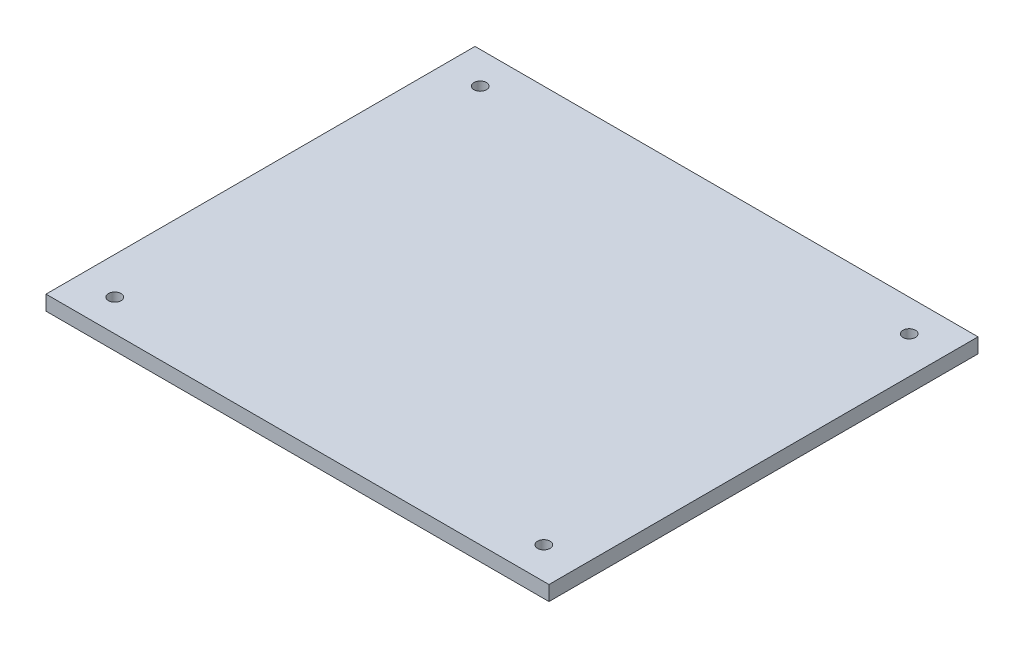
ISO-10303-21;
HEADER;
FILE_DESCRIPTION(('STEP AP214'),'2;1');
FILE_NAME('part.step','',(''),(''),'','','');
FILE_SCHEMA(('AUTOMOTIVE_DESIGN { 1 0 10303 214 1 1 1 1 }'));
ENDSEC;
DATA;
#1=APPLICATION_CONTEXT('core data for automotive mechanical design processes');
#2=APPLICATION_PROTOCOL_DEFINITION('international standard','automotive_design',2000,#1);
#3=PRODUCT_CONTEXT('',#1,'mechanical');
#4=PRODUCT('Part','Part','',(#3));
#5=PRODUCT_RELATED_PRODUCT_CATEGORY('part','',(#4));
#6=PRODUCT_DEFINITION_FORMATION('','',#4);
#7=PRODUCT_DEFINITION_CONTEXT('part definition',#1,'design');
#8=PRODUCT_DEFINITION('design','',#6,#7);
#9=PRODUCT_DEFINITION_SHAPE('','',#8);
#10=(LENGTH_UNIT() NAMED_UNIT(*) SI_UNIT(.MILLI.,.METRE.));
#11=(NAMED_UNIT(*) PLANE_ANGLE_UNIT() SI_UNIT($,.RADIAN.));
#12=(NAMED_UNIT(*) SI_UNIT($,.STERADIAN.) SOLID_ANGLE_UNIT());
#13=UNCERTAINTY_MEASURE_WITH_UNIT(LENGTH_MEASURE(1.E-05),#10,'distance_accuracy_value','');
#14=(GEOMETRIC_REPRESENTATION_CONTEXT(3) GLOBAL_UNCERTAINTY_ASSIGNED_CONTEXT((#13)) GLOBAL_UNIT_ASSIGNED_CONTEXT((#10,
#11,#12)) REPRESENTATION_CONTEXT('',''));
#15=CARTESIAN_POINT('',(0.,0.,0.));
#16=DIRECTION('',(0.,0.,1.));
#17=DIRECTION('',(1.,0.,0.));
#18=AXIS2_PLACEMENT_3D('',#15,#16,#17);
#19=CARTESIAN_POINT('',(0.,5.08,0.));
#20=DIRECTION('',(1.,0.,0.));
#21=DIRECTION('',(0.,0.,-1.));
#22=AXIS2_PLACEMENT_3D('',#19,#20,#21);
#23=PLANE('',#22);
#24=DIRECTION('',(0.,0.,1.));
#25=VECTOR('',#24,1.);
#26=CARTESIAN_POINT('',(0.,0.,0.));
#27=LINE('',#26,#25);
#28=CARTESIAN_POINT('',(0.,0.,-147.32));
#29=VERTEX_POINT('',#28);
#30=CARTESIAN_POINT('',(0.,0.,0.));
#31=VERTEX_POINT('',#30);
#32=EDGE_CURVE('E101',#29,#31,#27,.T.);
#33=ORIENTED_EDGE('',*,*,#32,.T.);
#34=DIRECTION('',(0.,-1.,0.));
#35=VECTOR('',#34,1.);
#36=CARTESIAN_POINT('',(0.,5.08,0.));
#37=LINE('',#36,#35);
#38=CARTESIAN_POINT('',(0.,5.08,0.));
#39=VERTEX_POINT('',#38);
#40=EDGE_CURVE('E11',#39,#31,#37,.T.);
#41=ORIENTED_EDGE('',*,*,#40,.F.);
#42=DIRECTION('',(0.,0.,1.));
#43=VECTOR('',#42,1.);
#44=CARTESIAN_POINT('',(0.,5.08,0.));
#45=LINE('',#44,#43);
#46=CARTESIAN_POINT('',(0.,5.08,-147.32));
#47=VERTEX_POINT('',#46);
#48=EDGE_CURVE('E89',#47,#39,#45,.T.);
#49=ORIENTED_EDGE('',*,*,#48,.F.);
#50=DIRECTION('',(0.,-1.,0.));
#51=VECTOR('',#50,1.);
#52=CARTESIAN_POINT('',(0.,5.08,-147.32));
#53=LINE('',#52,#51);
#54=EDGE_CURVE('E97',#47,#29,#53,.T.);
#55=ORIENTED_EDGE('',*,*,#54,.T.);
#56=EDGE_LOOP('',(#33,#41,#49,#55));
#57=FACE_BOUND('',#56,.T.);
#58=ADVANCED_FACE('F38',(#57),#23,.F.);
#59=CARTESIAN_POINT('',(0.,5.08,0.));
#60=DIRECTION('',(0.,0.,-1.));
#61=DIRECTION('',(-1.,0.,0.));
#62=AXIS2_PLACEMENT_3D('',#59,#60,#61);
#63=PLANE('',#62);
#64=DIRECTION('',(1.,0.,0.));
#65=VECTOR('',#64,1.);
#66=CARTESIAN_POINT('',(0.,0.,0.));
#67=LINE('',#66,#65);
#68=CARTESIAN_POINT('',(172.72,0.,0.));
#69=VERTEX_POINT('',#68);
#70=EDGE_CURVE('E93',#31,#69,#67,.T.);
#71=ORIENTED_EDGE('',*,*,#70,.T.);
#72=DIRECTION('',(0.,-1.,0.));
#73=VECTOR('',#72,1.);
#74=CARTESIAN_POINT('',(172.72,5.08,0.));
#75=LINE('',#74,#73);
#76=CARTESIAN_POINT('',(172.72,5.08,0.));
#77=VERTEX_POINT('',#76);
#78=EDGE_CURVE('E46',#77,#69,#75,.T.);
#79=ORIENTED_EDGE('',*,*,#78,.F.);
#80=DIRECTION('',(1.,0.,0.));
#81=VECTOR('',#80,1.);
#82=CARTESIAN_POINT('',(0.,5.08,0.));
#83=LINE('',#82,#81);
#84=EDGE_CURVE('E84',#39,#77,#83,.T.);
#85=ORIENTED_EDGE('',*,*,#84,.F.);
#86=ORIENTED_EDGE('',*,*,#40,.T.);
#87=EDGE_LOOP('',(#71,#79,#85,#86));
#88=FACE_BOUND('',#87,.T.);
#89=ADVANCED_FACE('F92',(#88),#63,.F.);
#90=CARTESIAN_POINT('',(172.72,5.08,0.));
#91=DIRECTION('',(-1.,0.,0.));
#92=DIRECTION('',(0.,0.,1.));
#93=AXIS2_PLACEMENT_3D('',#90,#91,#92);
#94=PLANE('',#93);
#95=DIRECTION('',(0.,0.,-1.));
#96=VECTOR('',#95,1.);
#97=CARTESIAN_POINT('',(172.72,0.,0.));
#98=LINE('',#97,#96);
#99=CARTESIAN_POINT('',(172.72,0.,-147.32));
#100=VERTEX_POINT('',#99);
#101=EDGE_CURVE('E71',#69,#100,#98,.T.);
#102=ORIENTED_EDGE('',*,*,#101,.T.);
#103=DIRECTION('',(0.,-1.,0.));
#104=VECTOR('',#103,1.);
#105=CARTESIAN_POINT('',(172.72,5.08,-147.32));
#106=LINE('',#105,#104);
#107=CARTESIAN_POINT('',(172.72,5.08,-147.32));
#108=VERTEX_POINT('',#107);
#109=EDGE_CURVE('E94',#108,#100,#106,.T.);
#110=ORIENTED_EDGE('',*,*,#109,.F.);
#111=DIRECTION('',(0.,0.,-1.));
#112=VECTOR('',#111,1.);
#113=CARTESIAN_POINT('',(172.72,5.08,0.));
#114=LINE('',#113,#112);
#115=EDGE_CURVE('E87',#77,#108,#114,.T.);
#116=ORIENTED_EDGE('',*,*,#115,.F.);
#117=ORIENTED_EDGE('',*,*,#78,.T.);
#118=EDGE_LOOP('',(#102,#110,#116,#117));
#119=FACE_BOUND('',#118,.T.);
#120=ADVANCED_FACE('F95',(#119),#94,.F.);
#121=CARTESIAN_POINT('',(0.,5.08,-147.32));
#122=DIRECTION('',(0.,0.,1.));
#123=DIRECTION('',(1.,0.,0.));
#124=AXIS2_PLACEMENT_3D('',#121,#122,#123);
#125=PLANE('',#124);
#126=DIRECTION('',(-1.,0.,0.));
#127=VECTOR('',#126,1.);
#128=CARTESIAN_POINT('',(0.,0.,-147.32));
#129=LINE('',#128,#127);
#130=EDGE_CURVE('E77',#100,#29,#129,.T.);
#131=ORIENTED_EDGE('',*,*,#130,.T.);
#132=ORIENTED_EDGE('',*,*,#54,.F.);
#133=DIRECTION('',(-1.,0.,0.));
#134=VECTOR('',#133,1.);
#135=CARTESIAN_POINT('',(0.,5.08,-147.32));
#136=LINE('',#135,#134);
#137=EDGE_CURVE('E54',#108,#47,#136,.T.);
#138=ORIENTED_EDGE('',*,*,#137,.F.);
#139=ORIENTED_EDGE('',*,*,#109,.T.);
#140=EDGE_LOOP('',(#131,#132,#138,#139));
#141=FACE_BOUND('',#140,.T.);
#142=ADVANCED_FACE('F109',(#141),#125,.F.);
#143=CARTESIAN_POINT('',(0.,5.08,0.));
#144=DIRECTION('',(0.,-1.,0.));
#145=DIRECTION('',(0.,0.,-1.));
#146=AXIS2_PLACEMENT_3D('',#143,#144,#145);
#147=PLANE('',#146);
#148=CARTESIAN_POINT('',(12.6999999999999,5.08,-10.922));
#149=DIRECTION('',(0.,1.,0.));
#150=DIRECTION('',(0.,0.,1.));
#151=AXIS2_PLACEMENT_3D('',#148,#149,#150);
#152=CIRCLE('',#151,2.159);
#153=CARTESIAN_POINT('',(12.6999999999999,5.08,-8.763));
#154=VERTEX_POINT('',#153);
#155=EDGE_CURVE('E124',#154,#154,#152,.T.);
#156=ORIENTED_EDGE('',*,*,#155,.F.);
#157=EDGE_LOOP('',(#156));
#158=FACE_BOUND('',#157,.T.);
#159=CARTESIAN_POINT('',(160.02,5.08,-10.922));
#160=DIRECTION('',(0.,1.,0.));
#161=DIRECTION('',(0.,0.,1.));
#162=AXIS2_PLACEMENT_3D('',#159,#160,#161);
#163=CIRCLE('',#162,2.15899999999999);
#164=CARTESIAN_POINT('',(160.02,5.08,-8.76300000000001));
#165=VERTEX_POINT('',#164);
#166=EDGE_CURVE('E130',#165,#165,#163,.T.);
#167=ORIENTED_EDGE('',*,*,#166,.F.);
#168=EDGE_LOOP('',(#167));
#169=FACE_BOUND('',#168,.T.);
#170=CARTESIAN_POINT('',(160.02,5.08,-136.398));
#171=DIRECTION('',(0.,1.,0.));
#172=DIRECTION('',(0.,0.,1.));
#173=AXIS2_PLACEMENT_3D('',#170,#171,#172);
#174=CIRCLE('',#173,2.15899999999999);
#175=CARTESIAN_POINT('',(160.02,5.08,-134.239));
#176=VERTEX_POINT('',#175);
#177=EDGE_CURVE('E118',#176,#176,#174,.T.);
#178=ORIENTED_EDGE('',*,*,#177,.F.);
#179=EDGE_LOOP('',(#178));
#180=FACE_BOUND('',#179,.T.);
#181=CARTESIAN_POINT('',(12.6999999999999,5.08,-136.398));
#182=DIRECTION('',(0.,1.,0.));
#183=DIRECTION('',(0.,0.,1.));
#184=AXIS2_PLACEMENT_3D('',#181,#182,#183);
#185=CIRCLE('',#184,2.15899999999999);
#186=CARTESIAN_POINT('',(12.6999999999999,5.08,-134.239));
#187=VERTEX_POINT('',#186);
#188=EDGE_CURVE('E115',#187,#187,#185,.T.);
#189=ORIENTED_EDGE('',*,*,#188,.F.);
#190=EDGE_LOOP('',(#189));
#191=FACE_BOUND('',#190,.T.);
#192=ORIENTED_EDGE('',*,*,#48,.T.);
#193=ORIENTED_EDGE('',*,*,#84,.T.);
#194=ORIENTED_EDGE('',*,*,#115,.T.);
#195=ORIENTED_EDGE('',*,*,#137,.T.);
#196=EDGE_LOOP('',(#192,#193,#194,#195));
#197=FACE_BOUND('',#196,.T.);
#198=ADVANCED_FACE('F85',(#158,#169,#180,#191,#197),#147,.F.);
#199=CARTESIAN_POINT('',(0.,0.,0.));
#200=DIRECTION('',(0.,-1.,0.));
#201=DIRECTION('',(0.,0.,-1.));
#202=AXIS2_PLACEMENT_3D('',#199,#200,#201);
#203=PLANE('',#202);
#204=CARTESIAN_POINT('',(12.6999999999999,0.,-10.922));
#205=DIRECTION('',(0.,1.,0.));
#206=DIRECTION('',(0.,0.,1.));
#207=AXIS2_PLACEMENT_3D('',#204,#205,#206);
#208=CIRCLE('',#207,2.159);
#209=CARTESIAN_POINT('',(12.6999999999999,0.,-8.763));
#210=VERTEX_POINT('',#209);
#211=EDGE_CURVE('E121',#210,#210,#208,.T.);
#212=ORIENTED_EDGE('',*,*,#211,.T.);
#213=EDGE_LOOP('',(#212));
#214=FACE_BOUND('',#213,.T.);
#215=CARTESIAN_POINT('',(160.02,0.,-10.922));
#216=DIRECTION('',(0.,1.,0.));
#217=DIRECTION('',(0.,0.,1.));
#218=AXIS2_PLACEMENT_3D('',#215,#216,#217);
#219=CIRCLE('',#218,2.15899999999999);
#220=CARTESIAN_POINT('',(160.02,0.,-8.76300000000001));
#221=VERTEX_POINT('',#220);
#222=EDGE_CURVE('E127',#221,#221,#219,.T.);
#223=ORIENTED_EDGE('',*,*,#222,.T.);
#224=EDGE_LOOP('',(#223));
#225=FACE_BOUND('',#224,.T.);
#226=CARTESIAN_POINT('',(160.02,0.,-136.398));
#227=DIRECTION('',(0.,1.,0.));
#228=DIRECTION('',(0.,0.,1.));
#229=AXIS2_PLACEMENT_3D('',#226,#227,#228);
#230=CIRCLE('',#229,2.15899999999999);
#231=CARTESIAN_POINT('',(160.02,0.,-134.239));
#232=VERTEX_POINT('',#231);
#233=EDGE_CURVE('E133',#232,#232,#230,.T.);
#234=ORIENTED_EDGE('',*,*,#233,.T.);
#235=EDGE_LOOP('',(#234));
#236=FACE_BOUND('',#235,.T.);
#237=CARTESIAN_POINT('',(12.6999999999999,0.,-136.398));
#238=DIRECTION('',(0.,1.,0.));
#239=DIRECTION('',(0.,0.,1.));
#240=AXIS2_PLACEMENT_3D('',#237,#238,#239);
#241=CIRCLE('',#240,2.15899999999999);
#242=CARTESIAN_POINT('',(12.6999999999999,0.,-134.239));
#243=VERTEX_POINT('',#242);
#244=EDGE_CURVE('E104',#243,#243,#241,.T.);
#245=ORIENTED_EDGE('',*,*,#244,.T.);
#246=EDGE_LOOP('',(#245));
#247=FACE_BOUND('',#246,.T.);
#248=ORIENTED_EDGE('',*,*,#32,.F.);
#249=ORIENTED_EDGE('',*,*,#130,.F.);
#250=ORIENTED_EDGE('',*,*,#101,.F.);
#251=ORIENTED_EDGE('',*,*,#70,.F.);
#252=EDGE_LOOP('',(#248,#249,#250,#251));
#253=FACE_BOUND('',#252,.T.);
#254=ADVANCED_FACE('F112',(#214,#225,#236,#247,#253),#203,.T.);
#255=CARTESIAN_POINT('',(12.6999999999999,0.,-136.398));
#256=DIRECTION('',(0.,1.,0.));
#257=DIRECTION('',(0.,0.,1.));
#258=AXIS2_PLACEMENT_3D('',#255,#256,#257);
#259=CYLINDRICAL_SURFACE('',#258,2.15899999999999);
#260=ORIENTED_EDGE('',*,*,#244,.F.);
#261=EDGE_LOOP('',(#260));
#262=FACE_BOUND('',#261,.T.);
#263=ORIENTED_EDGE('',*,*,#188,.T.);
#264=EDGE_LOOP('',(#263));
#265=FACE_BOUND('',#264,.T.);
#266=ADVANCED_FACE('F147',(#262,#265),#259,.F.);
#267=CARTESIAN_POINT('',(160.02,0.,-136.398));
#268=DIRECTION('',(0.,1.,0.));
#269=DIRECTION('',(0.,0.,1.));
#270=AXIS2_PLACEMENT_3D('',#267,#268,#269);
#271=CYLINDRICAL_SURFACE('',#270,2.15899999999999);
#272=ORIENTED_EDGE('',*,*,#233,.F.);
#273=EDGE_LOOP('',(#272));
#274=FACE_BOUND('',#273,.T.);
#275=ORIENTED_EDGE('',*,*,#177,.T.);
#276=EDGE_LOOP('',(#275));
#277=FACE_BOUND('',#276,.T.);
#278=ADVANCED_FACE('F139',(#274,#277),#271,.F.);
#279=CARTESIAN_POINT('',(160.02,0.,-10.922));
#280=DIRECTION('',(0.,1.,0.));
#281=DIRECTION('',(0.,0.,1.));
#282=AXIS2_PLACEMENT_3D('',#279,#280,#281);
#283=CYLINDRICAL_SURFACE('',#282,2.15899999999999);
#284=ORIENTED_EDGE('',*,*,#222,.F.);
#285=EDGE_LOOP('',(#284));
#286=FACE_BOUND('',#285,.T.);
#287=ORIENTED_EDGE('',*,*,#166,.T.);
#288=EDGE_LOOP('',(#287));
#289=FACE_BOUND('',#288,.T.);
#290=ADVANCED_FACE('F155',(#286,#289),#283,.F.);
#291=CARTESIAN_POINT('',(12.6999999999999,0.,-10.922));
#292=DIRECTION('',(0.,1.,0.));
#293=DIRECTION('',(0.,0.,1.));
#294=AXIS2_PLACEMENT_3D('',#291,#292,#293);
#295=CYLINDRICAL_SURFACE('',#294,2.159);
#296=ORIENTED_EDGE('',*,*,#211,.F.);
#297=EDGE_LOOP('',(#296));
#298=FACE_BOUND('',#297,.T.);
#299=ORIENTED_EDGE('',*,*,#155,.T.);
#300=EDGE_LOOP('',(#299));
#301=FACE_BOUND('',#300,.T.);
#302=ADVANCED_FACE('F206',(#298,#301),#295,.F.);
#303=CLOSED_SHELL('',(#58,#89,#120,#142,#198,#254,#266,#278,#290,#302));
#304=MANIFOLD_SOLID_BREP('B2',#303);
#305=ADVANCED_BREP_SHAPE_REPRESENTATION('',(#18,#304),#14);
#306=SHAPE_DEFINITION_REPRESENTATION(#9,#305);
ENDSEC;
END-ISO-10303-21;
